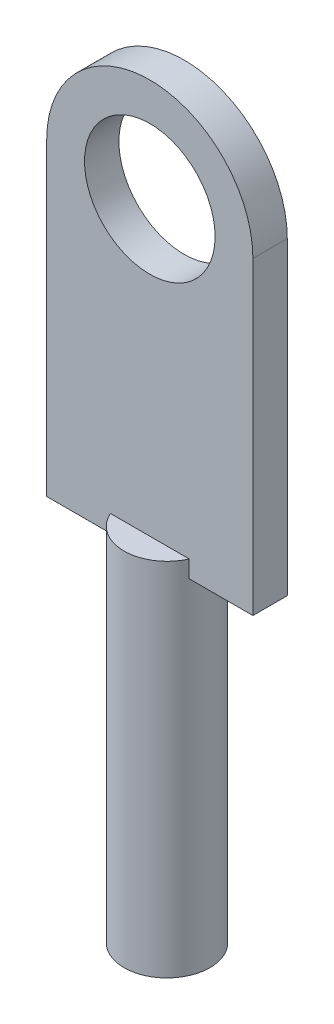
ISO-10303-21;
HEADER;
FILE_DESCRIPTION(('STEP AP214'),'2;1');
FILE_NAME('part.step','',(''),(''),'','','');
FILE_SCHEMA(('AUTOMOTIVE_DESIGN { 1 0 10303 214 1 1 1 1 }'));
ENDSEC;
DATA;
#1=APPLICATION_CONTEXT('core data for automotive mechanical design processes');
#2=APPLICATION_PROTOCOL_DEFINITION('international standard','automotive_design',2000,#1);
#3=PRODUCT_CONTEXT('',#1,'mechanical');
#4=PRODUCT('Part','Part','',(#3));
#5=PRODUCT_RELATED_PRODUCT_CATEGORY('part','',(#4));
#6=PRODUCT_DEFINITION_FORMATION('','',#4);
#7=PRODUCT_DEFINITION_CONTEXT('part definition',#1,'design');
#8=PRODUCT_DEFINITION('design','',#6,#7);
#9=PRODUCT_DEFINITION_SHAPE('','',#8);
#10=(LENGTH_UNIT() NAMED_UNIT(*) SI_UNIT(.MILLI.,.METRE.));
#11=(NAMED_UNIT(*) PLANE_ANGLE_UNIT() SI_UNIT($,.RADIAN.));
#12=(NAMED_UNIT(*) SI_UNIT($,.STERADIAN.) SOLID_ANGLE_UNIT());
#13=UNCERTAINTY_MEASURE_WITH_UNIT(LENGTH_MEASURE(1.E-05),#10,'distance_accuracy_value','');
#14=(GEOMETRIC_REPRESENTATION_CONTEXT(3) GLOBAL_UNCERTAINTY_ASSIGNED_CONTEXT((#13)) GLOBAL_UNIT_ASSIGNED_CONTEXT((#10,
#11,#12)) REPRESENTATION_CONTEXT('',''));
#15=CARTESIAN_POINT('',(0.,0.,0.));
#16=DIRECTION('',(0.,0.,1.));
#17=DIRECTION('',(1.,0.,0.));
#18=AXIS2_PLACEMENT_3D('',#15,#16,#17);
#19=CARTESIAN_POINT('',(0.,8.255,0.));
#20=DIRECTION('',(0.,1.,0.));
#21=DIRECTION('',(0.,0.,1.));
#22=AXIS2_PLACEMENT_3D('',#19,#20,#21);
#23=PLANE('',#22);
#24=CARTESIAN_POINT('',(0.,8.255,0.));
#25=DIRECTION('',(0.,1.,0.));
#26=DIRECTION('',(0.,0.,1.));
#27=AXIS2_PLACEMENT_3D('',#24,#25,#26);
#28=CIRCLE('',#27,1.5875);
#29=CARTESIAN_POINT('',(1.45496778314848,8.255,-0.635));
#30=VERTEX_POINT('',#29);
#31=CARTESIAN_POINT('',(-1.45496778314848,8.255,-0.635));
#32=VERTEX_POINT('',#31);
#33=EDGE_CURVE('E161',#30,#32,#28,.T.);
#34=ORIENTED_EDGE('',*,*,#33,.T.);
#35=DIRECTION('',(1.,0.,0.));
#36=VECTOR('',#35,1.);
#37=CARTESIAN_POINT('',(0.,8.255,-0.635));
#38=LINE('',#37,#36);
#39=EDGE_CURVE('E162',#32,#30,#38,.T.);
#40=ORIENTED_EDGE('',*,*,#39,.T.);
#41=EDGE_LOOP('',(#34,#40));
#42=FACE_BOUND('',#41,.T.);
#43=ADVANCED_FACE('F36',(#42),#23,.T.);
#44=CARTESIAN_POINT('',(0.,8.255,0.));
#45=DIRECTION('',(0.,-1.,0.));
#46=DIRECTION('',(0.,0.,-1.));
#47=AXIS2_PLACEMENT_3D('',#44,#45,#46);
#48=CYLINDRICAL_SURFACE('',#47,1.5875);
#49=CARTESIAN_POINT('',(0.,7.62,0.));
#50=DIRECTION('',(0.,1.,0.));
#51=DIRECTION('',(0.,0.,1.));
#52=AXIS2_PLACEMENT_3D('',#49,#50,#51);
#53=CIRCLE('',#52,1.5875);
#54=CARTESIAN_POINT('',(1.45496778314848,7.62,0.635));
#55=VERTEX_POINT('',#54);
#56=CARTESIAN_POINT('',(1.45496778314848,7.62,-0.635));
#57=VERTEX_POINT('',#56);
#58=EDGE_CURVE('E11',#55,#57,#53,.T.);
#59=ORIENTED_EDGE('',*,*,#58,.F.);
#60=DIRECTION('',(0.,-1.,0.));
#61=VECTOR('',#60,1.);
#62=CARTESIAN_POINT('',(1.45496778314848,8.255,0.635));
#63=LINE('',#62,#61);
#64=CARTESIAN_POINT('',(1.45496778314848,8.255,0.635));
#65=VERTEX_POINT('',#64);
#66=EDGE_CURVE('E153',#55,#65,#63,.F.);
#67=ORIENTED_EDGE('',*,*,#66,.T.);
#68=CARTESIAN_POINT('',(-1.45496778314848,8.255,0.635));
#69=VERTEX_POINT('',#68);
#70=EDGE_CURVE('E158',#69,#65,#28,.T.);
#71=ORIENTED_EDGE('',*,*,#70,.F.);
#72=DIRECTION('',(0.,-1.,0.));
#73=VECTOR('',#72,1.);
#74=CARTESIAN_POINT('',(-1.45496778314848,8.255,0.635));
#75=LINE('',#74,#73);
#76=CARTESIAN_POINT('',(-1.45496778314848,7.62,0.635));
#77=VERTEX_POINT('',#76);
#78=EDGE_CURVE('E155',#69,#77,#75,.T.);
#79=ORIENTED_EDGE('',*,*,#78,.T.);
#80=CARTESIAN_POINT('',(-1.45496778314848,7.62,-0.635));
#81=VERTEX_POINT('',#80);
#82=EDGE_CURVE('E40',#81,#77,#53,.T.);
#83=ORIENTED_EDGE('',*,*,#82,.F.);
#84=DIRECTION('',(0.,-1.,0.));
#85=VECTOR('',#84,1.);
#86=CARTESIAN_POINT('',(-1.45496778314848,8.255,-0.635));
#87=LINE('',#86,#85);
#88=EDGE_CURVE('E151',#32,#81,#87,.T.);
#89=ORIENTED_EDGE('',*,*,#88,.F.);
#90=ORIENTED_EDGE('',*,*,#33,.F.);
#91=DIRECTION('',(0.,-1.,0.));
#92=VECTOR('',#91,1.);
#93=CARTESIAN_POINT('',(1.45496778314848,8.255,-0.635));
#94=LINE('',#93,#92);
#95=EDGE_CURVE('E51',#57,#30,#94,.F.);
#96=ORIENTED_EDGE('',*,*,#95,.F.);
#97=EDGE_LOOP('',(#59,#67,#71,#79,#83,#89,#90,#96));
#98=FACE_BOUND('',#97,.T.);
#99=CARTESIAN_POINT('',(0.,-5.08,0.));
#100=DIRECTION('',(0.,-1.,0.));
#101=DIRECTION('',(0.,0.,-1.));
#102=AXIS2_PLACEMENT_3D('',#99,#100,#101);
#103=CIRCLE('',#102,1.5875);
#104=CARTESIAN_POINT('',(0.,-5.08,-1.5875));
#105=VERTEX_POINT('',#104);
#106=EDGE_CURVE('E225',#105,#105,#103,.T.);
#107=ORIENTED_EDGE('',*,*,#106,.F.);
#108=EDGE_LOOP('',(#107));
#109=FACE_BOUND('',#108,.T.);
#110=ADVANCED_FACE('F38',(#98,#109),#48,.T.);
#111=DIRECTION('',(1.,0.,0.));
#112=VECTOR('',#111,1.);
#113=CARTESIAN_POINT('',(0.,8.255,0.635));
#114=LINE('',#113,#112);
#115=EDGE_CURVE('E59',#69,#65,#114,.T.);
#116=ORIENTED_EDGE('',*,*,#115,.F.);
#117=ORIENTED_EDGE('',*,*,#70,.T.);
#118=EDGE_LOOP('',(#116,#117));
#119=FACE_BOUND('',#118,.T.);
#120=ADVANCED_FACE('F174',(#119),#23,.T.);
#121=CARTESIAN_POINT('',(-3.81,7.62,0.635));
#122=DIRECTION('',(0.,1.,0.));
#123=DIRECTION('',(0.,0.,1.));
#124=AXIS2_PLACEMENT_3D('',#121,#122,#123);
#125=PLANE('',#124);
#126=DIRECTION('',(1.,0.,0.));
#127=VECTOR('',#126,1.);
#128=CARTESIAN_POINT('',(-3.81,7.62,0.635));
#129=LINE('',#128,#127);
#130=CARTESIAN_POINT('',(3.81,7.62,0.635));
#131=VERTEX_POINT('',#130);
#132=EDGE_CURVE('E139',#55,#131,#129,.T.);
#133=ORIENTED_EDGE('',*,*,#132,.F.);
#134=ORIENTED_EDGE('',*,*,#58,.T.);
#135=DIRECTION('',(1.,0.,0.));
#136=VECTOR('',#135,1.);
#137=CARTESIAN_POINT('',(-3.81,7.62,-0.635));
#138=LINE('',#137,#136);
#139=CARTESIAN_POINT('',(3.81,7.62,-0.635));
#140=VERTEX_POINT('',#139);
#141=EDGE_CURVE('E111',#57,#140,#138,.T.);
#142=ORIENTED_EDGE('',*,*,#141,.T.);
#143=DIRECTION('',(0.,0.,-1.));
#144=VECTOR('',#143,1.);
#145=CARTESIAN_POINT('',(3.81,7.62,0.635));
#146=LINE('',#145,#144);
#147=EDGE_CURVE('E146',#131,#140,#146,.T.);
#148=ORIENTED_EDGE('',*,*,#147,.F.);
#149=EDGE_LOOP('',(#133,#134,#142,#148));
#150=FACE_BOUND('',#149,.T.);
#151=ADVANCED_FACE('F176',(#150),#125,.F.);
#152=CARTESIAN_POINT('',(-3.81,7.62,-0.635));
#153=VERTEX_POINT('',#152);
#154=EDGE_CURVE('E107',#153,#81,#138,.T.);
#155=ORIENTED_EDGE('',*,*,#154,.T.);
#156=ORIENTED_EDGE('',*,*,#82,.T.);
#157=CARTESIAN_POINT('',(-3.81,7.62,0.635));
#158=VERTEX_POINT('',#157);
#159=EDGE_CURVE('E140',#158,#77,#129,.T.);
#160=ORIENTED_EDGE('',*,*,#159,.F.);
#161=DIRECTION('',(0.,0.,-1.));
#162=VECTOR('',#161,1.);
#163=CARTESIAN_POINT('',(-3.81,7.62,0.635));
#164=LINE('',#163,#162);
#165=EDGE_CURVE('E120',#158,#153,#164,.T.);
#166=ORIENTED_EDGE('',*,*,#165,.T.);
#167=EDGE_LOOP('',(#155,#156,#160,#166));
#168=FACE_BOUND('',#167,.T.);
#169=ADVANCED_FACE('F166',(#168),#125,.F.);
#170=CARTESIAN_POINT('',(0.,19.05,0.635));
#171=DIRECTION('',(0.,0.,1.));
#172=DIRECTION('',(1.,0.,0.));
#173=AXIS2_PLACEMENT_3D('',#170,#171,#172);
#174=PLANE('',#173);
#175=CARTESIAN_POINT('',(0.,19.05,0.635));
#176=DIRECTION('',(0.,0.,1.));
#177=DIRECTION('',(1.,0.,0.));
#178=AXIS2_PLACEMENT_3D('',#175,#176,#177);
#179=CIRCLE('',#178,2.413);
#180=CARTESIAN_POINT('',(2.413,19.05,0.635));
#181=VERTEX_POINT('',#180);
#182=EDGE_CURVE('E126',#181,#181,#179,.T.);
#183=ORIENTED_EDGE('',*,*,#182,.F.);
#184=EDGE_LOOP('',(#183));
#185=FACE_BOUND('',#184,.T.);
#186=ORIENTED_EDGE('',*,*,#78,.F.);
#187=ORIENTED_EDGE('',*,*,#115,.T.);
#188=ORIENTED_EDGE('',*,*,#66,.F.);
#189=ORIENTED_EDGE('',*,*,#132,.T.);
#190=DIRECTION('',(0.,1.,0.));
#191=VECTOR('',#190,1.);
#192=CARTESIAN_POINT('',(3.81,19.05,0.635));
#193=LINE('',#192,#191);
#194=CARTESIAN_POINT('',(3.81,19.05,0.635));
#195=VERTEX_POINT('',#194);
#196=EDGE_CURVE('E143',#131,#195,#193,.T.);
#197=ORIENTED_EDGE('',*,*,#196,.T.);
#198=CARTESIAN_POINT('',(0.,19.05,0.635));
#199=DIRECTION('',(0.,0.,1.));
#200=DIRECTION('',(1.,0.,0.));
#201=AXIS2_PLACEMENT_3D('',#198,#199,#200);
#202=CIRCLE('',#201,3.81);
#203=CARTESIAN_POINT('',(-3.81,19.05,0.635));
#204=VERTEX_POINT('',#203);
#205=EDGE_CURVE('E136',#195,#204,#202,.T.);
#206=ORIENTED_EDGE('',*,*,#205,.T.);
#207=DIRECTION('',(0.,-1.,0.));
#208=VECTOR('',#207,1.);
#209=CARTESIAN_POINT('',(-3.81,19.05,0.635));
#210=LINE('',#209,#208);
#211=EDGE_CURVE('E116',#204,#158,#210,.T.);
#212=ORIENTED_EDGE('',*,*,#211,.T.);
#213=ORIENTED_EDGE('',*,*,#159,.T.);
#214=EDGE_LOOP('',(#186,#187,#188,#189,#197,#206,#212,#213));
#215=FACE_BOUND('',#214,.T.);
#216=ADVANCED_FACE('F169',(#185,#215),#174,.T.);
#217=CARTESIAN_POINT('',(0.,19.05,-0.635));
#218=DIRECTION('',(0.,0.,1.));
#219=DIRECTION('',(1.,0.,0.));
#220=AXIS2_PLACEMENT_3D('',#217,#218,#219);
#221=PLANE('',#220);
#222=CARTESIAN_POINT('',(0.,19.05,-0.635));
#223=DIRECTION('',(0.,0.,1.));
#224=DIRECTION('',(1.,0.,0.));
#225=AXIS2_PLACEMENT_3D('',#222,#223,#224);
#226=CIRCLE('',#225,2.413);
#227=CARTESIAN_POINT('',(2.413,19.05,-0.635));
#228=VERTEX_POINT('',#227);
#229=EDGE_CURVE('E129',#228,#228,#226,.T.);
#230=ORIENTED_EDGE('',*,*,#229,.T.);
#231=EDGE_LOOP('',(#230));
#232=FACE_BOUND('',#231,.T.);
#233=ORIENTED_EDGE('',*,*,#39,.F.);
#234=ORIENTED_EDGE('',*,*,#88,.T.);
#235=ORIENTED_EDGE('',*,*,#154,.F.);
#236=DIRECTION('',(0.,-1.,0.));
#237=VECTOR('',#236,1.);
#238=CARTESIAN_POINT('',(-3.81,19.05,-0.635));
#239=LINE('',#238,#237);
#240=CARTESIAN_POINT('',(-3.81,19.05,-0.635));
#241=VERTEX_POINT('',#240);
#242=EDGE_CURVE('E100',#241,#153,#239,.T.);
#243=ORIENTED_EDGE('',*,*,#242,.F.);
#244=CARTESIAN_POINT('',(0.,19.05,-0.635));
#245=DIRECTION('',(0.,0.,1.));
#246=DIRECTION('',(1.,0.,0.));
#247=AXIS2_PLACEMENT_3D('',#244,#245,#246);
#248=CIRCLE('',#247,3.81);
#249=CARTESIAN_POINT('',(3.81,19.05,-0.635));
#250=VERTEX_POINT('',#249);
#251=EDGE_CURVE('E105',#250,#241,#248,.T.);
#252=ORIENTED_EDGE('',*,*,#251,.F.);
#253=DIRECTION('',(0.,1.,0.));
#254=VECTOR('',#253,1.);
#255=CARTESIAN_POINT('',(3.81,19.05,-0.635));
#256=LINE('',#255,#254);
#257=EDGE_CURVE('E134',#140,#250,#256,.T.);
#258=ORIENTED_EDGE('',*,*,#257,.F.);
#259=ORIENTED_EDGE('',*,*,#141,.F.);
#260=ORIENTED_EDGE('',*,*,#95,.T.);
#261=EDGE_LOOP('',(#233,#234,#235,#243,#252,#258,#259,#260));
#262=FACE_BOUND('',#261,.T.);
#263=ADVANCED_FACE('F102',(#232,#262),#221,.F.);
#264=CARTESIAN_POINT('',(0.,19.05,0.635));
#265=DIRECTION('',(0.,0.,-1.));
#266=DIRECTION('',(-1.,0.,0.));
#267=AXIS2_PLACEMENT_3D('',#264,#265,#266);
#268=CYLINDRICAL_SURFACE('',#267,3.81);
#269=ORIENTED_EDGE('',*,*,#251,.T.);
#270=DIRECTION('',(0.,0.,-1.));
#271=VECTOR('',#270,1.);
#272=CARTESIAN_POINT('',(-3.81,19.05,0.635));
#273=LINE('',#272,#271);
#274=EDGE_CURVE('E114',#204,#241,#273,.T.);
#275=ORIENTED_EDGE('',*,*,#274,.F.);
#276=ORIENTED_EDGE('',*,*,#205,.F.);
#277=DIRECTION('',(0.,0.,-1.));
#278=VECTOR('',#277,1.);
#279=CARTESIAN_POINT('',(3.81,19.05,0.635));
#280=LINE('',#279,#278);
#281=EDGE_CURVE('E125',#195,#250,#280,.T.);
#282=ORIENTED_EDGE('',*,*,#281,.T.);
#283=EDGE_LOOP('',(#269,#275,#276,#282));
#284=FACE_BOUND('',#283,.T.);
#285=ADVANCED_FACE('F123',(#284),#268,.T.);
#286=CARTESIAN_POINT('',(-3.81,19.05,0.635));
#287=DIRECTION('',(1.,0.,0.));
#288=DIRECTION('',(0.,1.,0.));
#289=AXIS2_PLACEMENT_3D('',#286,#287,#288);
#290=PLANE('',#289);
#291=ORIENTED_EDGE('',*,*,#242,.T.);
#292=ORIENTED_EDGE('',*,*,#165,.F.);
#293=ORIENTED_EDGE('',*,*,#211,.F.);
#294=ORIENTED_EDGE('',*,*,#274,.T.);
#295=EDGE_LOOP('',(#291,#292,#293,#294));
#296=FACE_BOUND('',#295,.T.);
#297=ADVANCED_FACE('F115',(#296),#290,.F.);
#298=CARTESIAN_POINT('',(3.81,19.05,0.635));
#299=DIRECTION('',(-1.,0.,0.));
#300=DIRECTION('',(0.,-1.,0.));
#301=AXIS2_PLACEMENT_3D('',#298,#299,#300);
#302=PLANE('',#301);
#303=ORIENTED_EDGE('',*,*,#257,.T.);
#304=ORIENTED_EDGE('',*,*,#281,.F.);
#305=ORIENTED_EDGE('',*,*,#196,.F.);
#306=ORIENTED_EDGE('',*,*,#147,.T.);
#307=EDGE_LOOP('',(#303,#304,#305,#306));
#308=FACE_BOUND('',#307,.T.);
#309=ADVANCED_FACE('F193',(#308),#302,.F.);
#310=CARTESIAN_POINT('',(0.,19.05,0.635));
#311=DIRECTION('',(0.,0.,-1.));
#312=DIRECTION('',(-1.,0.,0.));
#313=AXIS2_PLACEMENT_3D('',#310,#311,#312);
#314=CYLINDRICAL_SURFACE('',#313,2.413);
#315=ORIENTED_EDGE('',*,*,#182,.T.);
#316=EDGE_LOOP('',(#315));
#317=FACE_BOUND('',#316,.T.);
#318=ORIENTED_EDGE('',*,*,#229,.F.);
#319=EDGE_LOOP('',(#318));
#320=FACE_BOUND('',#319,.T.);
#321=ADVANCED_FACE('F196',(#317,#320),#314,.F.);
#322=CARTESIAN_POINT('',(0.,-5.08,0.));
#323=DIRECTION('',(0.,-1.,0.));
#324=DIRECTION('',(0.,0.,-1.));
#325=AXIS2_PLACEMENT_3D('',#322,#323,#324);
#326=PLANE('',#325);
#327=ORIENTED_EDGE('',*,*,#106,.T.);
#328=EDGE_LOOP('',(#327));
#329=FACE_BOUND('',#328,.T.);
#330=ADVANCED_FACE('F202',(#329),#326,.T.);
#331=CLOSED_SHELL('',(#43,#110,#120,#151,#169,#216,#263,#285,#297,#309,#321,#330));
#332=MANIFOLD_SOLID_BREP('B2',#331);
#333=ADVANCED_BREP_SHAPE_REPRESENTATION('',(#18,#332),#14);
#334=SHAPE_DEFINITION_REPRESENTATION(#9,#333);
ENDSEC;
END-ISO-10303-21;
